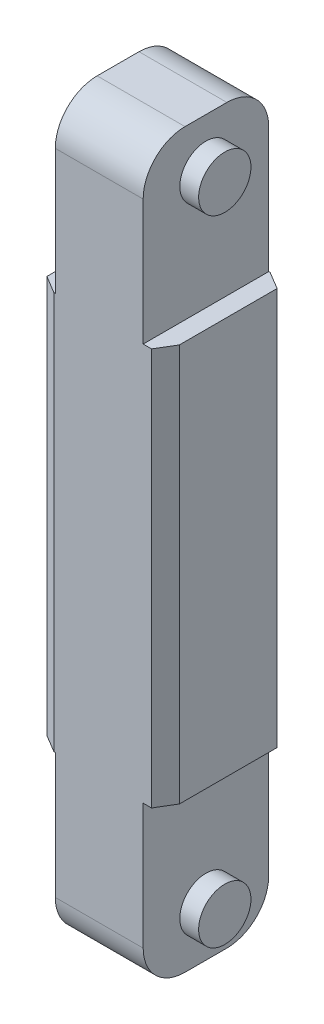
ISO-10303-21;
HEADER;
FILE_DESCRIPTION(('STEP AP214'),'2;1');
FILE_NAME('part.step','',(''),(''),'','','');
FILE_SCHEMA(('AUTOMOTIVE_DESIGN { 1 0 10303 214 1 1 1 1 }'));
ENDSEC;
DATA;
#1=APPLICATION_CONTEXT('core data for automotive mechanical design processes');
#2=APPLICATION_PROTOCOL_DEFINITION('international standard','automotive_design',2000,#1);
#3=PRODUCT_CONTEXT('',#1,'mechanical');
#4=PRODUCT('Part','Part','',(#3));
#5=PRODUCT_RELATED_PRODUCT_CATEGORY('part','',(#4));
#6=PRODUCT_DEFINITION_FORMATION('','',#4);
#7=PRODUCT_DEFINITION_CONTEXT('part definition',#1,'design');
#8=PRODUCT_DEFINITION('design','',#6,#7);
#9=PRODUCT_DEFINITION_SHAPE('','',#8);
#10=(LENGTH_UNIT() NAMED_UNIT(*) SI_UNIT(.MILLI.,.METRE.));
#11=(NAMED_UNIT(*) PLANE_ANGLE_UNIT() SI_UNIT($,.RADIAN.));
#12=(NAMED_UNIT(*) SI_UNIT($,.STERADIAN.) SOLID_ANGLE_UNIT());
#13=UNCERTAINTY_MEASURE_WITH_UNIT(LENGTH_MEASURE(1.E-05),#10,'distance_accuracy_value','');
#14=(GEOMETRIC_REPRESENTATION_CONTEXT(3) GLOBAL_UNCERTAINTY_ASSIGNED_CONTEXT((#13)) GLOBAL_UNIT_ASSIGNED_CONTEXT((#10,
#11,#12)) REPRESENTATION_CONTEXT('',''));
#15=CARTESIAN_POINT('',(0.,0.,0.));
#16=DIRECTION('',(0.,0.,1.));
#17=DIRECTION('',(1.,0.,0.));
#18=AXIS2_PLACEMENT_3D('',#15,#16,#17);
#19=CARTESIAN_POINT('',(-60.,700.,-60.));
#20=DIRECTION('',(0.,0.,1.));
#21=DIRECTION('',(1.,0.,0.));
#22=AXIS2_PLACEMENT_3D('',#19,#20,#21);
#23=PLANE('',#22);
#24=DIRECTION('',(-1.,0.,0.));
#25=VECTOR('',#24,1.);
#26=CARTESIAN_POINT('',(60.,540.,-60.));
#27=LINE('',#26,#25);
#28=CARTESIAN_POINT('',(43.3572051764947,540.,-60.));
#29=VERTEX_POINT('',#28);
#30=CARTESIAN_POINT('',(42.,540.,-60.));
#31=VERTEX_POINT('',#30);
#32=EDGE_CURVE('E219',#29,#31,#27,.T.);
#33=ORIENTED_EDGE('',*,*,#32,.F.);
#34=DIRECTION('',(0.,-1.,0.));
#35=VECTOR('',#34,1.);
#36=CARTESIAN_POINT('',(43.3572051764947,700.,-60.));
#37=LINE('',#36,#35);
#38=CARTESIAN_POINT('',(43.3572051764947,160.,-60.));
#39=VERTEX_POINT('',#38);
#40=EDGE_CURVE('E321',#29,#39,#37,.T.);
#41=ORIENTED_EDGE('',*,*,#40,.T.);
#42=DIRECTION('',(1.,0.,0.));
#43=VECTOR('',#42,1.);
#44=CARTESIAN_POINT('',(60.,160.,-60.));
#45=LINE('',#44,#43);
#46=CARTESIAN_POINT('',(42.,160.,-60.));
#47=VERTEX_POINT('',#46);
#48=EDGE_CURVE('E247',#47,#39,#45,.T.);
#49=ORIENTED_EDGE('',*,*,#48,.F.);
#50=DIRECTION('',(0.,-1.,0.));
#51=VECTOR('',#50,1.);
#52=CARTESIAN_POINT('',(42.,160.,-60.));
#53=LINE('',#52,#51);
#54=CARTESIAN_POINT('',(42.,40.0000000000001,-60.));
#55=VERTEX_POINT('',#54);
#56=EDGE_CURVE('E254',#47,#55,#53,.T.);
#57=ORIENTED_EDGE('',*,*,#56,.T.);
#58=DIRECTION('',(-1.,0.,0.));
#59=VECTOR('',#58,1.);
#60=CARTESIAN_POINT('',(-60.,40.,-60.));
#61=LINE('',#60,#59);
#62=CARTESIAN_POINT('',(-42.,40.0000000000001,-60.));
#63=VERTEX_POINT('',#62);
#64=EDGE_CURVE('E296',#55,#63,#61,.T.);
#65=ORIENTED_EDGE('',*,*,#64,.T.);
#66=DIRECTION('',(0.,-1.,0.));
#67=VECTOR('',#66,1.);
#68=CARTESIAN_POINT('',(-42.,160.,-60.));
#69=LINE('',#68,#67);
#70=CARTESIAN_POINT('',(-42.,160.,-60.));
#71=VERTEX_POINT('',#70);
#72=EDGE_CURVE('E269',#71,#63,#69,.T.);
#73=ORIENTED_EDGE('',*,*,#72,.F.);
#74=DIRECTION('',(1.,0.,0.));
#75=VECTOR('',#74,1.);
#76=CARTESIAN_POINT('',(-60.,160.,-60.));
#77=LINE('',#76,#75);
#78=CARTESIAN_POINT('',(-49.9999999999999,160.,-60.));
#79=VERTEX_POINT('',#78);
#80=EDGE_CURVE('E262',#79,#71,#77,.T.);
#81=ORIENTED_EDGE('',*,*,#80,.F.);
#82=DIRECTION('',(0.,1.,0.));
#83=VECTOR('',#82,1.);
#84=CARTESIAN_POINT('',(-49.9999999999999,700.,-60.));
#85=LINE('',#84,#83);
#86=CARTESIAN_POINT('',(-49.9999999999999,540.,-60.));
#87=VERTEX_POINT('',#86);
#88=EDGE_CURVE('E319',#79,#87,#85,.T.);
#89=ORIENTED_EDGE('',*,*,#88,.T.);
#90=DIRECTION('',(1.,0.,0.));
#91=VECTOR('',#90,1.);
#92=CARTESIAN_POINT('',(-60.,540.,-60.));
#93=LINE('',#92,#91);
#94=CARTESIAN_POINT('',(-42.,540.,-60.));
#95=VERTEX_POINT('',#94);
#96=EDGE_CURVE('E199',#87,#95,#93,.T.);
#97=ORIENTED_EDGE('',*,*,#96,.T.);
#98=DIRECTION('',(0.,1.,0.));
#99=VECTOR('',#98,1.);
#100=CARTESIAN_POINT('',(-42.,540.,-60.));
#101=LINE('',#100,#99);
#102=CARTESIAN_POINT('',(-42.,660.,-60.));
#103=VERTEX_POINT('',#102);
#104=EDGE_CURVE('E198',#95,#103,#101,.T.);
#105=ORIENTED_EDGE('',*,*,#104,.T.);
#106=DIRECTION('',(-1.,0.,0.));
#107=VECTOR('',#106,1.);
#108=CARTESIAN_POINT('',(42.,660.,-60.));
#109=LINE('',#108,#107);
#110=CARTESIAN_POINT('',(42.,660.,-60.));
#111=VERTEX_POINT('',#110);
#112=EDGE_CURVE('E317',#103,#111,#109,.F.);
#113=ORIENTED_EDGE('',*,*,#112,.T.);
#114=DIRECTION('',(0.,1.,0.));
#115=VECTOR('',#114,1.);
#116=CARTESIAN_POINT('',(42.,540.,-60.));
#117=LINE('',#116,#115);
#118=EDGE_CURVE('E215',#31,#111,#117,.T.);
#119=ORIENTED_EDGE('',*,*,#118,.F.);
#120=EDGE_LOOP('',(#33,#41,#49,#57,#65,#73,#81,#89,#97,#105,#113,#119));
#121=FACE_BOUND('',#120,.T.);
#122=ADVANCED_FACE('F39',(#121),#23,.F.);
#123=CARTESIAN_POINT('',(-60.,700.,60.));
#124=DIRECTION('',(0.,0.,-1.));
#125=DIRECTION('',(-1.,0.,0.));
#126=AXIS2_PLACEMENT_3D('',#123,#124,#125);
#127=PLANE('',#126);
#128=DIRECTION('',(-1.,0.,0.));
#129=VECTOR('',#128,1.);
#130=CARTESIAN_POINT('',(60.,160.,60.));
#131=LINE('',#130,#129);
#132=CARTESIAN_POINT('',(49.9999999999999,160.,60.));
#133=VERTEX_POINT('',#132);
#134=CARTESIAN_POINT('',(42.,160.,60.));
#135=VERTEX_POINT('',#134);
#136=EDGE_CURVE('E241',#133,#135,#131,.T.);
#137=ORIENTED_EDGE('',*,*,#136,.F.);
#138=DIRECTION('',(0.,1.,0.));
#139=VECTOR('',#138,1.);
#140=CARTESIAN_POINT('',(49.9999999999999,700.,60.));
#141=LINE('',#140,#139);
#142=CARTESIAN_POINT('',(49.9999999999999,540.,60.));
#143=VERTEX_POINT('',#142);
#144=EDGE_CURVE('E339',#133,#143,#141,.T.);
#145=ORIENTED_EDGE('',*,*,#144,.T.);
#146=DIRECTION('',(-1.,0.,0.));
#147=VECTOR('',#146,1.);
#148=CARTESIAN_POINT('',(60.,540.,60.));
#149=LINE('',#148,#147);
#150=CARTESIAN_POINT('',(42.,540.,60.));
#151=VERTEX_POINT('',#150);
#152=EDGE_CURVE('E228',#143,#151,#149,.T.);
#153=ORIENTED_EDGE('',*,*,#152,.T.);
#154=DIRECTION('',(0.,1.,0.));
#155=VECTOR('',#154,1.);
#156=CARTESIAN_POINT('',(42.,540.,60.));
#157=LINE('',#156,#155);
#158=CARTESIAN_POINT('',(42.,660.,60.));
#159=VERTEX_POINT('',#158);
#160=EDGE_CURVE('E213',#151,#159,#157,.T.);
#161=ORIENTED_EDGE('',*,*,#160,.T.);
#162=DIRECTION('',(1.,0.,0.));
#163=VECTOR('',#162,1.);
#164=CARTESIAN_POINT('',(-42.,660.,60.));
#165=LINE('',#164,#163);
#166=CARTESIAN_POINT('',(-42.,660.,60.));
#167=VERTEX_POINT('',#166);
#168=EDGE_CURVE('E205',#159,#167,#165,.F.);
#169=ORIENTED_EDGE('',*,*,#168,.T.);
#170=DIRECTION('',(0.,1.,0.));
#171=VECTOR('',#170,1.);
#172=CARTESIAN_POINT('',(-42.,540.,60.));
#173=LINE('',#172,#171);
#174=CARTESIAN_POINT('',(-42.,540.,60.));
#175=VERTEX_POINT('',#174);
#176=EDGE_CURVE('E195',#175,#167,#173,.T.);
#177=ORIENTED_EDGE('',*,*,#176,.F.);
#178=DIRECTION('',(1.,0.,0.));
#179=VECTOR('',#178,1.);
#180=CARTESIAN_POINT('',(-60.,540.,60.));
#181=LINE('',#180,#179);
#182=CARTESIAN_POINT('',(-43.3572051764946,540.,60.));
#183=VERTEX_POINT('',#182);
#184=EDGE_CURVE('E178',#183,#175,#181,.T.);
#185=ORIENTED_EDGE('',*,*,#184,.F.);
#186=DIRECTION('',(0.,-1.,0.));
#187=VECTOR('',#186,1.);
#188=CARTESIAN_POINT('',(-43.3572051764946,700.,60.));
#189=LINE('',#188,#187);
#190=CARTESIAN_POINT('',(-43.3572051764946,160.,60.));
#191=VERTEX_POINT('',#190);
#192=EDGE_CURVE('E337',#183,#191,#189,.T.);
#193=ORIENTED_EDGE('',*,*,#192,.T.);
#194=DIRECTION('',(-1.,0.,0.));
#195=VECTOR('',#194,1.);
#196=CARTESIAN_POINT('',(-60.,160.,60.));
#197=LINE('',#196,#195);
#198=CARTESIAN_POINT('',(-42.,160.,60.));
#199=VERTEX_POINT('',#198);
#200=EDGE_CURVE('E267',#199,#191,#197,.T.);
#201=ORIENTED_EDGE('',*,*,#200,.F.);
#202=DIRECTION('',(0.,-1.,0.));
#203=VECTOR('',#202,1.);
#204=CARTESIAN_POINT('',(-42.,160.,60.));
#205=LINE('',#204,#203);
#206=CARTESIAN_POINT('',(-42.,40.0000000000001,60.));
#207=VERTEX_POINT('',#206);
#208=EDGE_CURVE('E253',#199,#207,#205,.T.);
#209=ORIENTED_EDGE('',*,*,#208,.T.);
#210=DIRECTION('',(1.,0.,0.));
#211=VECTOR('',#210,1.);
#212=CARTESIAN_POINT('',(-60.,40.,60.));
#213=LINE('',#212,#211);
#214=CARTESIAN_POINT('',(42.,40.0000000000001,60.));
#215=VERTEX_POINT('',#214);
#216=EDGE_CURVE('E281',#207,#215,#213,.T.);
#217=ORIENTED_EDGE('',*,*,#216,.T.);
#218=DIRECTION('',(0.,-1.,0.));
#219=VECTOR('',#218,1.);
#220=CARTESIAN_POINT('',(42.,160.,60.));
#221=LINE('',#220,#219);
#222=EDGE_CURVE('E250',#135,#215,#221,.T.);
#223=ORIENTED_EDGE('',*,*,#222,.F.);
#224=EDGE_LOOP('',(#137,#145,#153,#161,#169,#177,#185,#193,#201,#209,#217,#223));
#225=FACE_BOUND('',#224,.T.);
#226=ADVANCED_FACE('F202',(#225),#127,.F.);
#227=CARTESIAN_POINT('',(0.,700.,0.));
#228=DIRECTION('',(0.,1.,0.));
#229=DIRECTION('',(0.,0.,1.));
#230=AXIS2_PLACEMENT_3D('',#227,#228,#229);
#231=PLANE('',#230);
#232=DIRECTION('',(0.,0.,1.));
#233=VECTOR('',#232,1.);
#234=CARTESIAN_POINT('',(-42.,700.,-60.));
#235=LINE('',#234,#233);
#236=CARTESIAN_POINT('',(-42.,700.,-20.));
#237=VERTEX_POINT('',#236);
#238=CARTESIAN_POINT('',(-42.,700.,20.));
#239=VERTEX_POINT('',#238);
#240=EDGE_CURVE('E189',#237,#239,#235,.T.);
#241=ORIENTED_EDGE('',*,*,#240,.T.);
#242=DIRECTION('',(1.,0.,0.));
#243=VECTOR('',#242,1.);
#244=CARTESIAN_POINT('',(42.,700.,20.));
#245=LINE('',#244,#243);
#246=CARTESIAN_POINT('',(42.,700.,20.));
#247=VERTEX_POINT('',#246);
#248=EDGE_CURVE('E305',#239,#247,#245,.T.);
#249=ORIENTED_EDGE('',*,*,#248,.T.);
#250=DIRECTION('',(0.,0.,1.));
#251=VECTOR('',#250,1.);
#252=CARTESIAN_POINT('',(42.,700.,-60.));
#253=LINE('',#252,#251);
#254=CARTESIAN_POINT('',(42.,700.,-20.));
#255=VERTEX_POINT('',#254);
#256=EDGE_CURVE('E220',#255,#247,#253,.T.);
#257=ORIENTED_EDGE('',*,*,#256,.F.);
#258=DIRECTION('',(-1.,0.,0.));
#259=VECTOR('',#258,1.);
#260=CARTESIAN_POINT('',(-42.,700.,-20.));
#261=LINE('',#260,#259);
#262=EDGE_CURVE('E302',#255,#237,#261,.T.);
#263=ORIENTED_EDGE('',*,*,#262,.T.);
#264=EDGE_LOOP('',(#241,#249,#257,#263));
#265=FACE_BOUND('',#264,.T.);
#266=ADVANCED_FACE('F414',(#265),#231,.T.);
#267=CARTESIAN_POINT('',(60.,700.,-60.));
#268=DIRECTION('',(-1.,0.,0.));
#269=DIRECTION('',(0.,0.,1.));
#270=AXIS2_PLACEMENT_3D('',#267,#268,#269);
#271=PLANE('',#270);
#272=DIRECTION('',(0.,0.,1.));
#273=VECTOR('',#272,1.);
#274=CARTESIAN_POINT('',(60.,160.,-60.));
#275=LINE('',#274,#273);
#276=CARTESIAN_POINT('',(60.,160.,-50.));
#277=VERTEX_POINT('',#276);
#278=CARTESIAN_POINT('',(60.,160.,43.3572051764946));
#279=VERTEX_POINT('',#278);
#280=EDGE_CURVE('E238',#277,#279,#275,.T.);
#281=ORIENTED_EDGE('',*,*,#280,.F.);
#282=DIRECTION('',(0.,1.,0.));
#283=VECTOR('',#282,1.);
#284=CARTESIAN_POINT('',(60.,700.,-50.));
#285=LINE('',#284,#283);
#286=CARTESIAN_POINT('',(60.,540.,-50.));
#287=VERTEX_POINT('',#286);
#288=EDGE_CURVE('E331',#277,#287,#285,.T.);
#289=ORIENTED_EDGE('',*,*,#288,.T.);
#290=DIRECTION('',(0.,0.,1.));
#291=VECTOR('',#290,1.);
#292=CARTESIAN_POINT('',(60.,540.,-60.));
#293=LINE('',#292,#291);
#294=CARTESIAN_POINT('',(60.,540.,43.3572051764946));
#295=VERTEX_POINT('',#294);
#296=EDGE_CURVE('E223',#287,#295,#293,.T.);
#297=ORIENTED_EDGE('',*,*,#296,.T.);
#298=DIRECTION('',(0.,-1.,0.));
#299=VECTOR('',#298,1.);
#300=CARTESIAN_POINT('',(60.,700.,43.3572051764946));
#301=LINE('',#300,#299);
#302=EDGE_CURVE('E328',#295,#279,#301,.T.);
#303=ORIENTED_EDGE('',*,*,#302,.T.);
#304=EDGE_LOOP('',(#281,#289,#297,#303));
#305=FACE_BOUND('',#304,.T.);
#306=ADVANCED_FACE('F396',(#305),#271,.F.);
#307=CARTESIAN_POINT('',(-60.,700.,-60.));
#308=DIRECTION('',(1.,0.,0.));
#309=DIRECTION('',(0.,0.,-1.));
#310=AXIS2_PLACEMENT_3D('',#307,#308,#309);
#311=PLANE('',#310);
#312=DIRECTION('',(0.,0.,1.));
#313=VECTOR('',#312,1.);
#314=CARTESIAN_POINT('',(-60.,540.,-60.));
#315=LINE('',#314,#313);
#316=CARTESIAN_POINT('',(-60.,540.,-43.3572051764946));
#317=VERTEX_POINT('',#316);
#318=CARTESIAN_POINT('',(-60.,540.,49.9999999999999));
#319=VERTEX_POINT('',#318);
#320=EDGE_CURVE('E206',#317,#319,#315,.T.);
#321=ORIENTED_EDGE('',*,*,#320,.F.);
#322=DIRECTION('',(0.,-1.,0.));
#323=VECTOR('',#322,1.);
#324=CARTESIAN_POINT('',(-60.,700.,-43.3572051764946));
#325=LINE('',#324,#323);
#326=CARTESIAN_POINT('',(-60.,160.,-43.3572051764946));
#327=VERTEX_POINT('',#326);
#328=EDGE_CURVE('E343',#317,#327,#325,.T.);
#329=ORIENTED_EDGE('',*,*,#328,.T.);
#330=DIRECTION('',(0.,0.,-1.));
#331=VECTOR('',#330,1.);
#332=CARTESIAN_POINT('',(-60.,160.,-60.));
#333=LINE('',#332,#331);
#334=CARTESIAN_POINT('',(-60.,160.,49.9999999999999));
#335=VERTEX_POINT('',#334);
#336=EDGE_CURVE('E260',#335,#327,#333,.T.);
#337=ORIENTED_EDGE('',*,*,#336,.F.);
#338=DIRECTION('',(0.,1.,0.));
#339=VECTOR('',#338,1.);
#340=CARTESIAN_POINT('',(-60.,700.,49.9999999999999));
#341=LINE('',#340,#339);
#342=EDGE_CURVE('E341',#335,#319,#341,.T.);
#343=ORIENTED_EDGE('',*,*,#342,.T.);
#344=EDGE_LOOP('',(#321,#329,#337,#343));
#345=FACE_BOUND('',#344,.T.);
#346=ADVANCED_FACE('F356',(#345),#311,.F.);
#347=CARTESIAN_POINT('',(0.,0.,0.));
#348=DIRECTION('',(0.,1.,0.));
#349=DIRECTION('',(0.,0.,1.));
#350=AXIS2_PLACEMENT_3D('',#347,#348,#349);
#351=PLANE('',#350);
#352=DIRECTION('',(0.,0.,-1.));
#353=VECTOR('',#352,1.);
#354=CARTESIAN_POINT('',(42.,0.,-60.));
#355=LINE('',#354,#353);
#356=CARTESIAN_POINT('',(42.,0.,20.));
#357=VERTEX_POINT('',#356);
#358=CARTESIAN_POINT('',(42.,0.,-20.));
#359=VERTEX_POINT('',#358);
#360=EDGE_CURVE('E242',#357,#359,#355,.T.);
#361=ORIENTED_EDGE('',*,*,#360,.F.);
#362=DIRECTION('',(1.,0.,0.));
#363=VECTOR('',#362,1.);
#364=CARTESIAN_POINT('',(0.,0.,20.));
#365=LINE('',#364,#363);
#366=CARTESIAN_POINT('',(-42.,0.,20.));
#367=VERTEX_POINT('',#366);
#368=EDGE_CURVE('E290',#357,#367,#365,.F.);
#369=ORIENTED_EDGE('',*,*,#368,.T.);
#370=DIRECTION('',(0.,0.,1.));
#371=VECTOR('',#370,1.);
#372=CARTESIAN_POINT('',(-42.,0.,-60.));
#373=LINE('',#372,#371);
#374=CARTESIAN_POINT('',(-42.,0.,-20.));
#375=VERTEX_POINT('',#374);
#376=EDGE_CURVE('E237',#375,#367,#373,.T.);
#377=ORIENTED_EDGE('',*,*,#376,.F.);
#378=DIRECTION('',(-1.,0.,0.));
#379=VECTOR('',#378,1.);
#380=CARTESIAN_POINT('',(0.,0.,-20.));
#381=LINE('',#380,#379);
#382=EDGE_CURVE('E288',#375,#359,#381,.F.);
#383=ORIENTED_EDGE('',*,*,#382,.T.);
#384=EDGE_LOOP('',(#361,#369,#377,#383));
#385=FACE_BOUND('',#384,.T.);
#386=ADVANCED_FACE('F374',(#385),#351,.F.);
#387=CARTESIAN_POINT('',(-42.,160.,-60.));
#388=DIRECTION('',(1.,0.,0.));
#389=DIRECTION('',(0.,0.,-1.));
#390=AXIS2_PLACEMENT_3D('',#387,#388,#389);
#391=PLANE('',#390);
#392=CARTESIAN_POINT('',(-42.,47.02,0.));
#393=DIRECTION('',(1.,0.,0.));
#394=DIRECTION('',(0.,0.,-1.));
#395=AXIS2_PLACEMENT_3D('',#392,#393,#394);
#396=CIRCLE('',#395,26.2285248449604);
#397=CARTESIAN_POINT('',(-42.,47.02,-26.2285248449604));
#398=VERTEX_POINT('',#397);
#399=EDGE_CURVE('E257',#398,#398,#396,.F.);
#400=ORIENTED_EDGE('',*,*,#399,.F.);
#401=EDGE_LOOP('',(#400));
#402=FACE_BOUND('',#401,.T.);
#403=ORIENTED_EDGE('',*,*,#376,.T.);
#404=CARTESIAN_POINT('',(-42.,40.,20.));
#405=DIRECTION('',(1.,0.,0.));
#406=DIRECTION('',(0.,0.,-1.));
#407=AXIS2_PLACEMENT_3D('',#404,#405,#406);
#408=CIRCLE('',#407,40.);
#409=EDGE_CURVE('E294',#367,#207,#408,.F.);
#410=ORIENTED_EDGE('',*,*,#409,.T.);
#411=ORIENTED_EDGE('',*,*,#208,.F.);
#412=DIRECTION('',(0.,0.,1.));
#413=VECTOR('',#412,1.);
#414=CARTESIAN_POINT('',(-42.,160.,-60.));
#415=LINE('',#414,#413);
#416=EDGE_CURVE('E264',#71,#199,#415,.T.);
#417=ORIENTED_EDGE('',*,*,#416,.F.);
#418=ORIENTED_EDGE('',*,*,#72,.T.);
#419=CARTESIAN_POINT('',(-42.,40.,-20.));
#420=DIRECTION('',(1.,0.,0.));
#421=DIRECTION('',(0.,0.,-1.));
#422=AXIS2_PLACEMENT_3D('',#419,#420,#421);
#423=CIRCLE('',#422,40.);
#424=EDGE_CURVE('E292',#63,#375,#423,.F.);
#425=ORIENTED_EDGE('',*,*,#424,.T.);
#426=EDGE_LOOP('',(#403,#410,#411,#417,#418,#425));
#427=FACE_BOUND('',#426,.T.);
#428=ADVANCED_FACE('F361',(#402,#427),#391,.F.);
#429=CARTESIAN_POINT('',(0.,160.,0.));
#430=DIRECTION('',(0.,1.,0.));
#431=DIRECTION('',(0.,0.,1.));
#432=AXIS2_PLACEMENT_3D('',#429,#430,#431);
#433=PLANE('',#432);
#434=ORIENTED_EDGE('',*,*,#336,.T.);
#435=DIRECTION('',(-0.515038074910054,0.,0.857167300702113));
#436=VECTOR('',#435,1.);
#437=CARTESIAN_POINT('',(-60.,160.,-43.3572051764946));
#438=LINE('',#437,#436);
#439=EDGE_CURVE('E55',#327,#79,#438,.F.);
#440=ORIENTED_EDGE('',*,*,#439,.T.);
#441=ORIENTED_EDGE('',*,*,#80,.T.);
#442=ORIENTED_EDGE('',*,*,#416,.T.);
#443=ORIENTED_EDGE('',*,*,#200,.T.);
#444=DIRECTION('',(0.857167300702114,0.,0.515038074910052));
#445=VECTOR('',#444,1.);
#446=CARTESIAN_POINT('',(-43.3572051764946,160.,60.));
#447=LINE('',#446,#445);
#448=EDGE_CURVE('E63',#191,#335,#447,.F.);
#449=ORIENTED_EDGE('',*,*,#448,.T.);
#450=EDGE_LOOP('',(#434,#440,#441,#442,#443,#449));
#451=FACE_BOUND('',#450,.T.);
#452=ADVANCED_FACE('F347',(#451),#433,.F.);
#453=CARTESIAN_POINT('',(42.,160.,-60.));
#454=DIRECTION('',(-1.,0.,0.));
#455=DIRECTION('',(0.,0.,1.));
#456=AXIS2_PLACEMENT_3D('',#453,#454,#455);
#457=PLANE('',#456);
#458=CARTESIAN_POINT('',(42.,47.02,0.));
#459=DIRECTION('',(-1.,0.,0.));
#460=DIRECTION('',(0.,0.,1.));
#461=AXIS2_PLACEMENT_3D('',#458,#459,#460);
#462=CIRCLE('',#461,25.);
#463=CARTESIAN_POINT('',(42.,47.02,25.));
#464=VERTEX_POINT('',#463);
#465=EDGE_CURVE('E278',#464,#464,#462,.F.);
#466=ORIENTED_EDGE('',*,*,#465,.F.);
#467=EDGE_LOOP('',(#466));
#468=FACE_BOUND('',#467,.T.);
#469=ORIENTED_EDGE('',*,*,#222,.T.);
#470=CARTESIAN_POINT('',(42.,40.,20.));
#471=DIRECTION('',(-1.,0.,0.));
#472=DIRECTION('',(0.,0.,1.));
#473=AXIS2_PLACEMENT_3D('',#470,#471,#472);
#474=CIRCLE('',#473,40.);
#475=EDGE_CURVE('E286',#215,#357,#474,.F.);
#476=ORIENTED_EDGE('',*,*,#475,.T.);
#477=ORIENTED_EDGE('',*,*,#360,.T.);
#478=CARTESIAN_POINT('',(42.,40.,-20.));
#479=DIRECTION('',(-1.,0.,0.));
#480=DIRECTION('',(0.,0.,1.));
#481=AXIS2_PLACEMENT_3D('',#478,#479,#480);
#482=CIRCLE('',#481,40.);
#483=EDGE_CURVE('E284',#359,#55,#482,.F.);
#484=ORIENTED_EDGE('',*,*,#483,.T.);
#485=ORIENTED_EDGE('',*,*,#56,.F.);
#486=DIRECTION('',(0.,0.,-1.));
#487=VECTOR('',#486,1.);
#488=CARTESIAN_POINT('',(42.,160.,-60.));
#489=LINE('',#488,#487);
#490=EDGE_CURVE('E244',#135,#47,#489,.T.);
#491=ORIENTED_EDGE('',*,*,#490,.F.);
#492=EDGE_LOOP('',(#469,#476,#477,#484,#485,#491));
#493=FACE_BOUND('',#492,.T.);
#494=ADVANCED_FACE('F370',(#468,#493),#457,.F.);
#495=CARTESIAN_POINT('',(0.,160.,0.));
#496=DIRECTION('',(0.,-1.,0.));
#497=DIRECTION('',(0.,0.,-1.));
#498=AXIS2_PLACEMENT_3D('',#495,#496,#497);
#499=PLANE('',#498);
#500=ORIENTED_EDGE('',*,*,#48,.T.);
#501=DIRECTION('',(-0.857167300702114,0.,-0.515038074910052));
#502=VECTOR('',#501,1.);
#503=CARTESIAN_POINT('',(37.9895429378963,160.,-63.2252168554151));
#504=LINE('',#503,#502);
#505=EDGE_CURVE('E326',#39,#277,#504,.F.);
#506=ORIENTED_EDGE('',*,*,#505,.T.);
#507=ORIENTED_EDGE('',*,*,#280,.T.);
#508=DIRECTION('',(0.515038074910054,0.,-0.857167300702112));
#509=VECTOR('',#508,1.);
#510=CARTESIAN_POINT('',(63.225216855415,160.,37.9895429378964));
#511=LINE('',#510,#509);
#512=EDGE_CURVE('E324',#279,#133,#511,.F.);
#513=ORIENTED_EDGE('',*,*,#512,.T.);
#514=ORIENTED_EDGE('',*,*,#136,.T.);
#515=ORIENTED_EDGE('',*,*,#490,.T.);
#516=EDGE_LOOP('',(#500,#506,#507,#513,#514,#515));
#517=FACE_BOUND('',#516,.T.);
#518=ADVANCED_FACE('F383',(#517),#499,.T.);
#519=CARTESIAN_POINT('',(-60.,47.02,0.));
#520=DIRECTION('',(1.,0.,0.));
#521=DIRECTION('',(0.,0.,-1.));
#522=AXIS2_PLACEMENT_3D('',#519,#520,#521);
#523=CYLINDRICAL_SURFACE('',#522,26.2285248449604);
#524=CARTESIAN_POINT('',(-60.,47.02,0.));
#525=DIRECTION('',(-1.,0.,0.));
#526=DIRECTION('',(0.,0.,1.));
#527=AXIS2_PLACEMENT_3D('',#524,#525,#526);
#528=CIRCLE('',#527,26.2285248449604);
#529=CARTESIAN_POINT('',(-60.,47.02,26.2285248449604));
#530=VERTEX_POINT('',#529);
#531=EDGE_CURVE('E234',#530,#530,#528,.T.);
#532=ORIENTED_EDGE('',*,*,#531,.F.);
#533=EDGE_LOOP('',(#532));
#534=FACE_BOUND('',#533,.T.);
#535=ORIENTED_EDGE('',*,*,#399,.T.);
#536=EDGE_LOOP('',(#535));
#537=FACE_BOUND('',#536,.T.);
#538=ADVANCED_FACE('F528',(#534,#537),#523,.T.);
#539=CARTESIAN_POINT('',(-60.,47.02,0.));
#540=DIRECTION('',(-1.,0.,0.));
#541=DIRECTION('',(0.,0.,1.));
#542=AXIS2_PLACEMENT_3D('',#539,#540,#541);
#543=PLANE('',#542);
#544=ORIENTED_EDGE('',*,*,#531,.T.);
#545=EDGE_LOOP('',(#544));
#546=FACE_BOUND('',#545,.T.);
#547=ADVANCED_FACE('F676',(#546),#543,.T.);
#548=CARTESIAN_POINT('',(60.,47.02,0.));
#549=DIRECTION('',(-1.,0.,0.));
#550=DIRECTION('',(0.,0.,1.));
#551=AXIS2_PLACEMENT_3D('',#548,#549,#550);
#552=CYLINDRICAL_SURFACE('',#551,25.);
#553=CARTESIAN_POINT('',(60.,47.02,0.));
#554=DIRECTION('',(1.,0.,0.));
#555=DIRECTION('',(0.,0.,-1.));
#556=AXIS2_PLACEMENT_3D('',#553,#554,#555);
#557=CIRCLE('',#556,25.);
#558=CARTESIAN_POINT('',(60.,47.02,-25.));
#559=VERTEX_POINT('',#558);
#560=EDGE_CURVE('E208',#559,#559,#557,.T.);
#561=ORIENTED_EDGE('',*,*,#560,.F.);
#562=EDGE_LOOP('',(#561));
#563=FACE_BOUND('',#562,.T.);
#564=ORIENTED_EDGE('',*,*,#465,.T.);
#565=EDGE_LOOP('',(#564));
#566=FACE_BOUND('',#565,.T.);
#567=ADVANCED_FACE('F666',(#563,#566),#552,.T.);
#568=CARTESIAN_POINT('',(60.,47.02,0.));
#569=DIRECTION('',(1.,0.,0.));
#570=DIRECTION('',(0.,0.,-1.));
#571=AXIS2_PLACEMENT_3D('',#568,#569,#570);
#572=PLANE('',#571);
#573=ORIENTED_EDGE('',*,*,#560,.T.);
#574=EDGE_LOOP('',(#573));
#575=FACE_BOUND('',#574,.T.);
#576=ADVANCED_FACE('F456',(#575),#572,.T.);
#577=CARTESIAN_POINT('',(-60.,40.,20.));
#578=DIRECTION('',(1.,0.,0.));
#579=DIRECTION('',(0.,0.,-1.));
#580=AXIS2_PLACEMENT_3D('',#577,#578,#579);
#581=CYLINDRICAL_SURFACE('',#580,40.);
#582=ORIENTED_EDGE('',*,*,#409,.F.);
#583=ORIENTED_EDGE('',*,*,#368,.F.);
#584=ORIENTED_EDGE('',*,*,#475,.F.);
#585=ORIENTED_EDGE('',*,*,#216,.F.);
#586=EDGE_LOOP('',(#582,#583,#584,#585));
#587=FACE_BOUND('',#586,.T.);
#588=ADVANCED_FACE('F366',(#587),#581,.T.);
#589=CARTESIAN_POINT('',(-60.,40.,-20.));
#590=DIRECTION('',(-1.,0.,0.));
#591=DIRECTION('',(0.,0.,1.));
#592=AXIS2_PLACEMENT_3D('',#589,#590,#591);
#593=CYLINDRICAL_SURFACE('',#592,40.);
#594=ORIENTED_EDGE('',*,*,#483,.F.);
#595=ORIENTED_EDGE('',*,*,#382,.F.);
#596=ORIENTED_EDGE('',*,*,#424,.F.);
#597=ORIENTED_EDGE('',*,*,#64,.F.);
#598=EDGE_LOOP('',(#594,#595,#596,#597));
#599=FACE_BOUND('',#598,.T.);
#600=ADVANCED_FACE('F378',(#599),#593,.T.);
#601=CARTESIAN_POINT('',(42.,540.,-60.));
#602=DIRECTION('',(-1.,0.,0.));
#603=DIRECTION('',(0.,0.,1.));
#604=AXIS2_PLACEMENT_3D('',#601,#602,#603);
#605=PLANE('',#604);
#606=CARTESIAN_POINT('',(42.,652.98,0.));
#607=DIRECTION('',(-1.,0.,0.));
#608=DIRECTION('',(0.,0.,1.));
#609=AXIS2_PLACEMENT_3D('',#606,#607,#608);
#610=CIRCLE('',#609,25.);
#611=CARTESIAN_POINT('',(42.,652.98,25.));
#612=VERTEX_POINT('',#611);
#613=EDGE_CURVE('E299',#612,#612,#610,.F.);
#614=ORIENTED_EDGE('',*,*,#613,.F.);
#615=EDGE_LOOP('',(#614));
#616=FACE_BOUND('',#615,.T.);
#617=ORIENTED_EDGE('',*,*,#256,.T.);
#618=CARTESIAN_POINT('',(42.,660.,20.));
#619=DIRECTION('',(-1.,0.,0.));
#620=DIRECTION('',(0.,0.,1.));
#621=AXIS2_PLACEMENT_3D('',#618,#619,#620);
#622=CIRCLE('',#621,40.);
#623=EDGE_CURVE('E310',#247,#159,#622,.F.);
#624=ORIENTED_EDGE('',*,*,#623,.T.);
#625=ORIENTED_EDGE('',*,*,#160,.F.);
#626=DIRECTION('',(0.,0.,1.));
#627=VECTOR('',#626,1.);
#628=CARTESIAN_POINT('',(42.,540.,-60.));
#629=LINE('',#628,#627);
#630=EDGE_CURVE('E225',#31,#151,#629,.T.);
#631=ORIENTED_EDGE('',*,*,#630,.F.);
#632=ORIENTED_EDGE('',*,*,#118,.T.);
#633=CARTESIAN_POINT('',(42.,660.,-20.));
#634=DIRECTION('',(-1.,0.,0.));
#635=DIRECTION('',(0.,0.,1.));
#636=AXIS2_PLACEMENT_3D('',#633,#634,#635);
#637=CIRCLE('',#636,40.);
#638=EDGE_CURVE('E308',#111,#255,#637,.F.);
#639=ORIENTED_EDGE('',*,*,#638,.T.);
#640=EDGE_LOOP('',(#617,#624,#625,#631,#632,#639));
#641=FACE_BOUND('',#640,.T.);
#642=ADVANCED_FACE('F405',(#616,#641),#605,.F.);
#643=CARTESIAN_POINT('',(0.,540.,0.));
#644=DIRECTION('',(0.,-1.,0.));
#645=DIRECTION('',(0.,0.,-1.));
#646=AXIS2_PLACEMENT_3D('',#643,#644,#645);
#647=PLANE('',#646);
#648=ORIENTED_EDGE('',*,*,#296,.F.);
#649=DIRECTION('',(0.857167300702114,0.,0.515038074910052));
#650=VECTOR('',#649,1.);
#651=CARTESIAN_POINT('',(43.3572051764947,540.,-60.));
#652=LINE('',#651,#650);
#653=EDGE_CURVE('E335',#287,#29,#652,.F.);
#654=ORIENTED_EDGE('',*,*,#653,.T.);
#655=ORIENTED_EDGE('',*,*,#32,.T.);
#656=ORIENTED_EDGE('',*,*,#630,.T.);
#657=ORIENTED_EDGE('',*,*,#152,.F.);
#658=DIRECTION('',(-0.515038074910054,0.,0.857167300702112));
#659=VECTOR('',#658,1.);
#660=CARTESIAN_POINT('',(60.,540.,43.3572051764946));
#661=LINE('',#660,#659);
#662=EDGE_CURVE('E333',#143,#295,#661,.F.);
#663=ORIENTED_EDGE('',*,*,#662,.T.);
#664=EDGE_LOOP('',(#648,#654,#655,#656,#657,#663));
#665=FACE_BOUND('',#664,.T.);
#666=ADVANCED_FACE('F393',(#665),#647,.F.);
#667=CARTESIAN_POINT('',(-42.,540.,-60.));
#668=DIRECTION('',(-1.,0.,0.));
#669=DIRECTION('',(0.,0.,1.));
#670=AXIS2_PLACEMENT_3D('',#667,#668,#669);
#671=PLANE('',#670);
#672=CARTESIAN_POINT('',(-42.,652.98,0.));
#673=DIRECTION('',(-1.,0.,0.));
#674=DIRECTION('',(0.,0.,1.));
#675=AXIS2_PLACEMENT_3D('',#672,#673,#674);
#676=CIRCLE('',#675,25.);
#677=CARTESIAN_POINT('',(-42.,652.98,25.));
#678=VERTEX_POINT('',#677);
#679=EDGE_CURVE('E418',#678,#678,#676,.T.);
#680=ORIENTED_EDGE('',*,*,#679,.F.);
#681=EDGE_LOOP('',(#680));
#682=FACE_BOUND('',#681,.T.);
#683=ORIENTED_EDGE('',*,*,#176,.T.);
#684=CARTESIAN_POINT('',(-42.,660.,20.));
#685=DIRECTION('',(-1.,0.,0.));
#686=DIRECTION('',(0.,0.,1.));
#687=AXIS2_PLACEMENT_3D('',#684,#685,#686);
#688=CIRCLE('',#687,40.);
#689=EDGE_CURVE('E315',#167,#239,#688,.T.);
#690=ORIENTED_EDGE('',*,*,#689,.T.);
#691=ORIENTED_EDGE('',*,*,#240,.F.);
#692=CARTESIAN_POINT('',(-42.,660.,-20.));
#693=DIRECTION('',(-1.,0.,0.));
#694=DIRECTION('',(0.,0.,1.));
#695=AXIS2_PLACEMENT_3D('',#692,#693,#694);
#696=CIRCLE('',#695,40.);
#697=EDGE_CURVE('E313',#237,#103,#696,.T.);
#698=ORIENTED_EDGE('',*,*,#697,.T.);
#699=ORIENTED_EDGE('',*,*,#104,.F.);
#700=DIRECTION('',(0.,0.,1.));
#701=VECTOR('',#700,1.);
#702=CARTESIAN_POINT('',(-42.,540.,-60.));
#703=LINE('',#702,#701);
#704=EDGE_CURVE('E182',#95,#175,#703,.T.);
#705=ORIENTED_EDGE('',*,*,#704,.T.);
#706=EDGE_LOOP('',(#683,#690,#691,#698,#699,#705));
#707=FACE_BOUND('',#706,.T.);
#708=ADVANCED_FACE('F194',(#682,#707),#671,.T.);
#709=CARTESIAN_POINT('',(0.,540.,0.));
#710=DIRECTION('',(0.,-1.,0.));
#711=DIRECTION('',(0.,0.,-1.));
#712=AXIS2_PLACEMENT_3D('',#709,#710,#711);
#713=PLANE('',#712);
#714=ORIENTED_EDGE('',*,*,#96,.F.);
#715=DIRECTION('',(0.515038074910054,0.,-0.857167300702113));
#716=VECTOR('',#715,1.);
#717=CARTESIAN_POINT('',(-60.,540.,-43.3572051764946));
#718=LINE('',#717,#716);
#719=EDGE_CURVE('E11',#87,#317,#718,.F.);
#720=ORIENTED_EDGE('',*,*,#719,.T.);
#721=ORIENTED_EDGE('',*,*,#320,.T.);
#722=DIRECTION('',(-0.857167300702114,0.,-0.515038074910052));
#723=VECTOR('',#722,1.);
#724=CARTESIAN_POINT('',(-43.3572051764946,540.,60.));
#725=LINE('',#724,#723);
#726=EDGE_CURVE('E48',#319,#183,#725,.F.);
#727=ORIENTED_EDGE('',*,*,#726,.T.);
#728=ORIENTED_EDGE('',*,*,#184,.T.);
#729=ORIENTED_EDGE('',*,*,#704,.F.);
#730=EDGE_LOOP('',(#714,#720,#721,#727,#728,#729));
#731=FACE_BOUND('',#730,.T.);
#732=ADVANCED_FACE('F181',(#731),#713,.F.);
#733=CARTESIAN_POINT('',(-60.,652.98,0.));
#734=DIRECTION('',(1.,0.,0.));
#735=DIRECTION('',(0.,0.,-1.));
#736=AXIS2_PLACEMENT_3D('',#733,#734,#735);
#737=CYLINDRICAL_SURFACE('',#736,25.);
#738=CARTESIAN_POINT('',(-60.,652.98,0.));
#739=DIRECTION('',(-1.,0.,0.));
#740=DIRECTION('',(0.,0.,1.));
#741=AXIS2_PLACEMENT_3D('',#738,#739,#740);
#742=CIRCLE('',#741,25.);
#743=CARTESIAN_POINT('',(-60.,652.98,25.));
#744=VERTEX_POINT('',#743);
#745=EDGE_CURVE('E216',#744,#744,#742,.T.);
#746=ORIENTED_EDGE('',*,*,#745,.F.);
#747=EDGE_LOOP('',(#746));
#748=FACE_BOUND('',#747,.T.);
#749=ORIENTED_EDGE('',*,*,#679,.T.);
#750=EDGE_LOOP('',(#749));
#751=FACE_BOUND('',#750,.T.);
#752=ADVANCED_FACE('F508',(#748,#751),#737,.T.);
#753=CARTESIAN_POINT('',(-60.,652.98,0.));
#754=DIRECTION('',(-1.,0.,0.));
#755=DIRECTION('',(0.,0.,1.));
#756=AXIS2_PLACEMENT_3D('',#753,#754,#755);
#757=PLANE('',#756);
#758=ORIENTED_EDGE('',*,*,#745,.T.);
#759=EDGE_LOOP('',(#758));
#760=FACE_BOUND('',#759,.T.);
#761=ADVANCED_FACE('F432',(#760),#757,.T.);
#762=CARTESIAN_POINT('',(60.,652.98,0.));
#763=DIRECTION('',(-1.,0.,0.));
#764=DIRECTION('',(0.,0.,1.));
#765=AXIS2_PLACEMENT_3D('',#762,#763,#764);
#766=CYLINDRICAL_SURFACE('',#765,25.);
#767=CARTESIAN_POINT('',(60.,652.98,0.));
#768=DIRECTION('',(1.,0.,0.));
#769=DIRECTION('',(0.,0.,-1.));
#770=AXIS2_PLACEMENT_3D('',#767,#768,#769);
#771=CIRCLE('',#770,25.);
#772=CARTESIAN_POINT('',(60.,652.98,-25.));
#773=VERTEX_POINT('',#772);
#774=EDGE_CURVE('E421',#773,#773,#771,.T.);
#775=ORIENTED_EDGE('',*,*,#774,.F.);
#776=EDGE_LOOP('',(#775));
#777=FACE_BOUND('',#776,.T.);
#778=ORIENTED_EDGE('',*,*,#613,.T.);
#779=EDGE_LOOP('',(#778));
#780=FACE_BOUND('',#779,.T.);
#781=ADVANCED_FACE('F429',(#777,#780),#766,.T.);
#782=CARTESIAN_POINT('',(60.,652.98,0.));
#783=DIRECTION('',(1.,0.,0.));
#784=DIRECTION('',(0.,0.,-1.));
#785=AXIS2_PLACEMENT_3D('',#782,#783,#784);
#786=PLANE('',#785);
#787=ORIENTED_EDGE('',*,*,#774,.T.);
#788=EDGE_LOOP('',(#787));
#789=FACE_BOUND('',#788,.T.);
#790=ADVANCED_FACE('F427',(#789),#786,.T.);
#791=CARTESIAN_POINT('',(0.,660.,20.));
#792=DIRECTION('',(-1.,0.,0.));
#793=DIRECTION('',(0.,0.,1.));
#794=AXIS2_PLACEMENT_3D('',#791,#792,#793);
#795=CYLINDRICAL_SURFACE('',#794,40.);
#796=ORIENTED_EDGE('',*,*,#689,.F.);
#797=ORIENTED_EDGE('',*,*,#168,.F.);
#798=ORIENTED_EDGE('',*,*,#623,.F.);
#799=ORIENTED_EDGE('',*,*,#248,.F.);
#800=EDGE_LOOP('',(#796,#797,#798,#799));
#801=FACE_BOUND('',#800,.T.);
#802=ADVANCED_FACE('F458',(#801),#795,.T.);
#803=CARTESIAN_POINT('',(0.,660.,-20.));
#804=DIRECTION('',(1.,0.,0.));
#805=DIRECTION('',(0.,0.,-1.));
#806=AXIS2_PLACEMENT_3D('',#803,#804,#805);
#807=CYLINDRICAL_SURFACE('',#806,40.);
#808=ORIENTED_EDGE('',*,*,#638,.F.);
#809=ORIENTED_EDGE('',*,*,#112,.F.);
#810=ORIENTED_EDGE('',*,*,#697,.F.);
#811=ORIENTED_EDGE('',*,*,#262,.F.);
#812=EDGE_LOOP('',(#808,#809,#810,#811));
#813=FACE_BOUND('',#812,.T.);
#814=ADVANCED_FACE('F410',(#813),#807,.T.);
#815=CARTESIAN_POINT('',(43.3572051764947,700.,-60.));
#816=DIRECTION('',(-0.515038074910052,0.,0.857167300702114));
#817=DIRECTION('',(0.,-1.,0.));
#818=AXIS2_PLACEMENT_3D('',#815,#816,#817);
#819=PLANE('',#818);
#820=ORIENTED_EDGE('',*,*,#653,.F.);
#821=ORIENTED_EDGE('',*,*,#288,.F.);
#822=ORIENTED_EDGE('',*,*,#505,.F.);
#823=ORIENTED_EDGE('',*,*,#40,.F.);
#824=EDGE_LOOP('',(#820,#821,#822,#823));
#825=FACE_BOUND('',#824,.T.);
#826=ADVANCED_FACE('F399',(#825),#819,.F.);
#827=CARTESIAN_POINT('',(60.,700.,43.3572051764946));
#828=DIRECTION('',(-0.857167300702112,0.,-0.515038074910054));
#829=DIRECTION('',(0.,-1.,0.));
#830=AXIS2_PLACEMENT_3D('',#827,#828,#829);
#831=PLANE('',#830);
#832=ORIENTED_EDGE('',*,*,#662,.F.);
#833=ORIENTED_EDGE('',*,*,#144,.F.);
#834=ORIENTED_EDGE('',*,*,#512,.F.);
#835=ORIENTED_EDGE('',*,*,#302,.F.);
#836=EDGE_LOOP('',(#832,#833,#834,#835));
#837=FACE_BOUND('',#836,.T.);
#838=ADVANCED_FACE('F389',(#837),#831,.F.);
#839=CARTESIAN_POINT('',(-60.,700.,-43.3572051764946));
#840=DIRECTION('',(0.857167300702113,0.,0.515038074910054));
#841=DIRECTION('',(0.,-1.,0.));
#842=AXIS2_PLACEMENT_3D('',#839,#840,#841);
#843=PLANE('',#842);
#844=ORIENTED_EDGE('',*,*,#719,.F.);
#845=ORIENTED_EDGE('',*,*,#88,.F.);
#846=ORIENTED_EDGE('',*,*,#439,.F.);
#847=ORIENTED_EDGE('',*,*,#328,.F.);
#848=EDGE_LOOP('',(#844,#845,#846,#847));
#849=FACE_BOUND('',#848,.T.);
#850=ADVANCED_FACE('F353',(#849),#843,.F.);
#851=CARTESIAN_POINT('',(-43.3572051764946,700.,60.));
#852=DIRECTION('',(0.515038074910052,0.,-0.857167300702114));
#853=DIRECTION('',(0.,-1.,0.));
#854=AXIS2_PLACEMENT_3D('',#851,#852,#853);
#855=PLANE('',#854);
#856=ORIENTED_EDGE('',*,*,#726,.F.);
#857=ORIENTED_EDGE('',*,*,#342,.F.);
#858=ORIENTED_EDGE('',*,*,#448,.F.);
#859=ORIENTED_EDGE('',*,*,#192,.F.);
#860=EDGE_LOOP('',(#856,#857,#858,#859));
#861=FACE_BOUND('',#860,.T.);
#862=ADVANCED_FACE('F42',(#861),#855,.F.);
#863=CLOSED_SHELL('',(#122,#226,#266,#306,#346,#386,#428,#452,#494,#518,#538,#547,#567,#576,
#588,#600,#642,#666,#708,#732,#752,#761,#781,#790,#802,#814,#826,#838,#850,#862));
#864=MANIFOLD_SOLID_BREP('B2',#863);
#865=ADVANCED_BREP_SHAPE_REPRESENTATION('',(#18,#864),#14);
#866=SHAPE_DEFINITION_REPRESENTATION(#9,#865);
ENDSEC;
END-ISO-10303-21;
